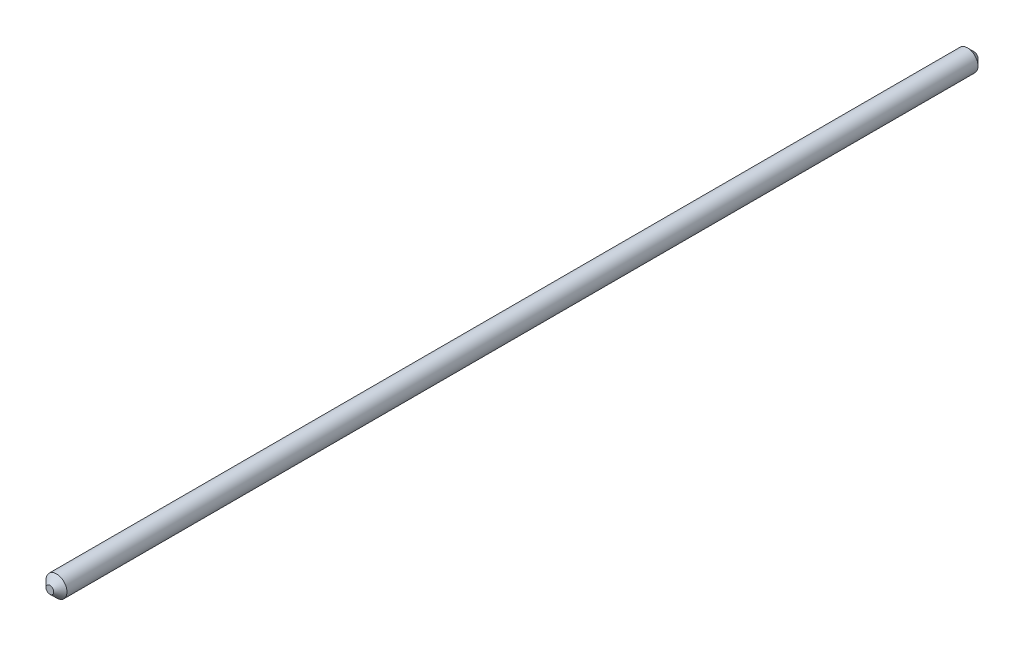
ISO-10303-21;
HEADER;
FILE_DESCRIPTION(('STEP AP214'),'2;1');
FILE_NAME('part.step','',(''),(''),'','','');
FILE_SCHEMA(('AUTOMOTIVE_DESIGN { 1 0 10303 214 1 1 1 1 }'));
ENDSEC;
DATA;
#1=APPLICATION_CONTEXT('core data for automotive mechanical design processes');
#2=APPLICATION_PROTOCOL_DEFINITION('international standard','automotive_design',2000,#1);
#3=PRODUCT_CONTEXT('',#1,'mechanical');
#4=PRODUCT('Part','Part','',(#3));
#5=PRODUCT_RELATED_PRODUCT_CATEGORY('part','',(#4));
#6=PRODUCT_DEFINITION_FORMATION('','',#4);
#7=PRODUCT_DEFINITION_CONTEXT('part definition',#1,'design');
#8=PRODUCT_DEFINITION('design','',#6,#7);
#9=PRODUCT_DEFINITION_SHAPE('','',#8);
#10=(LENGTH_UNIT() NAMED_UNIT(*) SI_UNIT(.MILLI.,.METRE.));
#11=(NAMED_UNIT(*) PLANE_ANGLE_UNIT() SI_UNIT($,.RADIAN.));
#12=(NAMED_UNIT(*) SI_UNIT($,.STERADIAN.) SOLID_ANGLE_UNIT());
#13=UNCERTAINTY_MEASURE_WITH_UNIT(LENGTH_MEASURE(1.E-05),#10,'distance_accuracy_value','');
#14=(GEOMETRIC_REPRESENTATION_CONTEXT(3) GLOBAL_UNCERTAINTY_ASSIGNED_CONTEXT((#13)) GLOBAL_UNIT_ASSIGNED_CONTEXT((#10,
#11,#12)) REPRESENTATION_CONTEXT('',''));
#15=CARTESIAN_POINT('',(0.,0.,0.));
#16=DIRECTION('',(0.,0.,1.));
#17=DIRECTION('',(1.,0.,0.));
#18=AXIS2_PLACEMENT_3D('',#15,#16,#17);
#19=CARTESIAN_POINT('',(0.,0.,280.));
#20=DIRECTION('',(0.,0.,-1.));
#21=DIRECTION('',(-1.,0.,0.));
#22=AXIS2_PLACEMENT_3D('',#19,#20,#21);
#23=CYLINDRICAL_SURFACE('',#22,3.175);
#24=CARTESIAN_POINT('',(0.,0.,278.));
#25=DIRECTION('',(0.,0.,1.));
#26=DIRECTION('',(1.,0.,0.));
#27=AXIS2_PLACEMENT_3D('',#24,#25,#26);
#28=CIRCLE('',#27,3.175);
#29=CARTESIAN_POINT('',(3.175,0.,278.));
#30=VERTEX_POINT('',#29);
#31=EDGE_CURVE('E54',#30,#30,#28,.F.);
#32=ORIENTED_EDGE('',*,*,#31,.T.);
#33=EDGE_LOOP('',(#32));
#34=FACE_BOUND('',#33,.T.);
#35=CARTESIAN_POINT('',(0.,0.,1.99999999999995));
#36=DIRECTION('',(0.,0.,1.));
#37=DIRECTION('',(1.,0.,0.));
#38=AXIS2_PLACEMENT_3D('',#35,#36,#37);
#39=CIRCLE('',#38,3.175);
#40=CARTESIAN_POINT('',(3.175,0.,1.99999999999995));
#41=VERTEX_POINT('',#40);
#42=EDGE_CURVE('E59',#41,#41,#39,.T.);
#43=ORIENTED_EDGE('',*,*,#42,.T.);
#44=EDGE_LOOP('',(#43));
#45=FACE_BOUND('',#44,.T.);
#46=ADVANCED_FACE('F45',(#34,#45),#23,.T.);
#47=CARTESIAN_POINT('',(0.,0.,280.));
#48=DIRECTION('',(0.,0.,1.));
#49=DIRECTION('',(1.,0.,0.));
#50=AXIS2_PLACEMENT_3D('',#47,#48,#49);
#51=PLANE('',#50);
#52=CARTESIAN_POINT('',(0.,0.,280.));
#53=DIRECTION('',(0.,0.,1.));
#54=DIRECTION('',(1.,0.,0.));
#55=AXIS2_PLACEMENT_3D('',#52,#53,#54);
#56=CIRCLE('',#55,1.17500000000001);
#57=CARTESIAN_POINT('',(1.17500000000001,0.,280.));
#58=VERTEX_POINT('',#57);
#59=EDGE_CURVE('E64',#58,#58,#56,.T.);
#60=ORIENTED_EDGE('',*,*,#59,.T.);
#61=EDGE_LOOP('',(#60));
#62=FACE_BOUND('',#61,.T.);
#63=ADVANCED_FACE('F71',(#62),#51,.T.);
#64=CARTESIAN_POINT('',(0.,0.,0.));
#65=DIRECTION('',(0.,0.,1.));
#66=DIRECTION('',(1.,0.,0.));
#67=AXIS2_PLACEMENT_3D('',#64,#65,#66);
#68=PLANE('',#67);
#69=CARTESIAN_POINT('',(0.,0.,0.));
#70=DIRECTION('',(0.,0.,1.));
#71=DIRECTION('',(1.,0.,0.));
#72=AXIS2_PLACEMENT_3D('',#69,#70,#71);
#73=CIRCLE('',#72,1.17500000000004);
#74=CARTESIAN_POINT('',(1.17500000000004,0.,0.));
#75=VERTEX_POINT('',#74);
#76=EDGE_CURVE('E10',#75,#75,#73,.F.);
#77=ORIENTED_EDGE('',*,*,#76,.T.);
#78=EDGE_LOOP('',(#77));
#79=FACE_BOUND('',#78,.T.);
#80=ADVANCED_FACE('F75',(#79),#68,.F.);
#81=CARTESIAN_POINT('',(0.,0.,280.));
#82=DIRECTION('',(0.,0.,-1.));
#83=DIRECTION('',(-1.,0.,0.));
#84=AXIS2_PLACEMENT_3D('',#81,#82,#83);
#85=CONICAL_SURFACE('',#84,1.17500000000001,0.785398163397459);
#86=ORIENTED_EDGE('',*,*,#31,.F.);
#87=EDGE_LOOP('',(#86));
#88=FACE_BOUND('',#87,.T.);
#89=ORIENTED_EDGE('',*,*,#59,.F.);
#90=EDGE_LOOP('',(#89));
#91=FACE_BOUND('',#90,.T.);
#92=ADVANCED_FACE('F73',(#88,#91),#85,.T.);
#93=CARTESIAN_POINT('',(0.,0.,1.99999999999995));
#94=DIRECTION('',(0.,0.,1.));
#95=DIRECTION('',(1.,0.,0.));
#96=AXIS2_PLACEMENT_3D('',#93,#94,#95);
#97=CONICAL_SURFACE('',#96,3.175,0.785398163397452);
#98=ORIENTED_EDGE('',*,*,#76,.F.);
#99=EDGE_LOOP('',(#98));
#100=FACE_BOUND('',#99,.T.);
#101=ORIENTED_EDGE('',*,*,#42,.F.);
#102=EDGE_LOOP('',(#101));
#103=FACE_BOUND('',#102,.T.);
#104=ADVANCED_FACE('F48',(#100,#103),#97,.T.);
#105=CLOSED_SHELL('',(#46,#63,#80,#92,#104));
#106=MANIFOLD_SOLID_BREP('B2',#105);
#107=ADVANCED_BREP_SHAPE_REPRESENTATION('',(#18,#106),#14);
#108=SHAPE_DEFINITION_REPRESENTATION(#9,#107);
ENDSEC;
END-ISO-10303-21;
